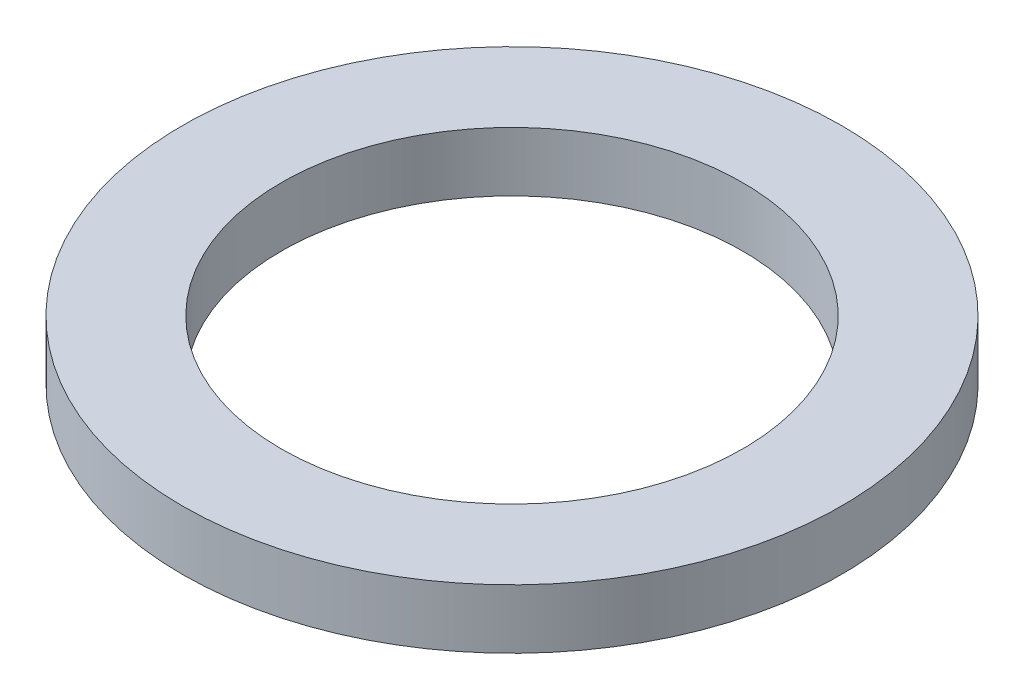
ISO-10303-21;
HEADER;
FILE_DESCRIPTION(('STEP AP214'),'2;1');
FILE_NAME('part.step','',(''),(''),'','','');
FILE_SCHEMA(('AUTOMOTIVE_DESIGN { 1 0 10303 214 1 1 1 1 }'));
ENDSEC;
DATA;
#1=APPLICATION_CONTEXT('core data for automotive mechanical design processes');
#2=APPLICATION_PROTOCOL_DEFINITION('international standard','automotive_design',2000,#1);
#3=PRODUCT_CONTEXT('',#1,'mechanical');
#4=PRODUCT('Part','Part','',(#3));
#5=PRODUCT_RELATED_PRODUCT_CATEGORY('part','',(#4));
#6=PRODUCT_DEFINITION_FORMATION('','',#4);
#7=PRODUCT_DEFINITION_CONTEXT('part definition',#1,'design');
#8=PRODUCT_DEFINITION('design','',#6,#7);
#9=PRODUCT_DEFINITION_SHAPE('','',#8);
#10=(LENGTH_UNIT() NAMED_UNIT(*) SI_UNIT(.MILLI.,.METRE.));
#11=(NAMED_UNIT(*) PLANE_ANGLE_UNIT() SI_UNIT($,.RADIAN.));
#12=(NAMED_UNIT(*) SI_UNIT($,.STERADIAN.) SOLID_ANGLE_UNIT());
#13=UNCERTAINTY_MEASURE_WITH_UNIT(LENGTH_MEASURE(1.E-05),#10,'distance_accuracy_value','');
#14=(GEOMETRIC_REPRESENTATION_CONTEXT(3) GLOBAL_UNCERTAINTY_ASSIGNED_CONTEXT((#13)) GLOBAL_UNIT_ASSIGNED_CONTEXT((#10,
#11,#12)) REPRESENTATION_CONTEXT('',''));
#15=CARTESIAN_POINT('',(0.,0.,0.));
#16=DIRECTION('',(0.,0.,1.));
#17=DIRECTION('',(1.,0.,0.));
#18=AXIS2_PLACEMENT_3D('',#15,#16,#17);
#19=CARTESIAN_POINT('',(0.,9.,0.));
#20=DIRECTION('',(0.,-1.,0.));
#21=DIRECTION('',(0.,0.,-1.));
#22=AXIS2_PLACEMENT_3D('',#19,#20,#21);
#23=CYLINDRICAL_SURFACE('',#22,50.);
#24=CARTESIAN_POINT('',(0.,9.,0.));
#25=DIRECTION('',(0.,1.,0.));
#26=DIRECTION('',(0.,0.,1.));
#27=AXIS2_PLACEMENT_3D('',#24,#25,#26);
#28=CIRCLE('',#27,50.);
#29=CARTESIAN_POINT('',(0.,9.,50.));
#30=VERTEX_POINT('',#29);
#31=EDGE_CURVE('E10',#30,#30,#28,.T.);
#32=ORIENTED_EDGE('',*,*,#31,.F.);
#33=EDGE_LOOP('',(#32));
#34=FACE_BOUND('',#33,.T.);
#35=CARTESIAN_POINT('',(0.,0.,0.));
#36=DIRECTION('',(0.,1.,0.));
#37=DIRECTION('',(0.,0.,1.));
#38=AXIS2_PLACEMENT_3D('',#35,#36,#37);
#39=CIRCLE('',#38,50.);
#40=CARTESIAN_POINT('',(0.,0.,50.));
#41=VERTEX_POINT('',#40);
#42=EDGE_CURVE('E37',#41,#41,#39,.T.);
#43=ORIENTED_EDGE('',*,*,#42,.T.);
#44=EDGE_LOOP('',(#43));
#45=FACE_BOUND('',#44,.T.);
#46=ADVANCED_FACE('F40',(#34,#45),#23,.T.);
#47=CARTESIAN_POINT('',(0.,9.,0.));
#48=DIRECTION('',(0.,1.,0.));
#49=DIRECTION('',(0.,0.,1.));
#50=AXIS2_PLACEMENT_3D('',#47,#48,#49);
#51=PLANE('',#50);
#52=CARTESIAN_POINT('',(0.,9.,0.));
#53=DIRECTION('',(0.,1.,0.));
#54=DIRECTION('',(0.,0.,1.));
#55=AXIS2_PLACEMENT_3D('',#52,#53,#54);
#56=CIRCLE('',#55,35.);
#57=CARTESIAN_POINT('',(0.,9.,35.));
#58=VERTEX_POINT('',#57);
#59=EDGE_CURVE('E50',#58,#58,#56,.T.);
#60=ORIENTED_EDGE('',*,*,#59,.F.);
#61=EDGE_LOOP('',(#60));
#62=FACE_BOUND('',#61,.T.);
#63=ORIENTED_EDGE('',*,*,#31,.T.);
#64=EDGE_LOOP('',(#63));
#65=FACE_BOUND('',#64,.T.);
#66=ADVANCED_FACE('F59',(#62,#65),#51,.T.);
#67=CARTESIAN_POINT('',(0.,0.,0.));
#68=DIRECTION('',(0.,1.,0.));
#69=DIRECTION('',(0.,0.,1.));
#70=AXIS2_PLACEMENT_3D('',#67,#68,#69);
#71=PLANE('',#70);
#72=CARTESIAN_POINT('',(0.,0.,0.));
#73=DIRECTION('',(0.,1.,0.));
#74=DIRECTION('',(0.,0.,1.));
#75=AXIS2_PLACEMENT_3D('',#72,#73,#74);
#76=CIRCLE('',#75,35.);
#77=CARTESIAN_POINT('',(0.,0.,35.));
#78=VERTEX_POINT('',#77);
#79=EDGE_CURVE('E47',#78,#78,#76,.T.);
#80=ORIENTED_EDGE('',*,*,#79,.T.);
#81=EDGE_LOOP('',(#80));
#82=FACE_BOUND('',#81,.T.);
#83=ORIENTED_EDGE('',*,*,#42,.F.);
#84=EDGE_LOOP('',(#83));
#85=FACE_BOUND('',#84,.T.);
#86=ADVANCED_FACE('F58',(#82,#85),#71,.F.);
#87=CARTESIAN_POINT('',(0.,9.,0.));
#88=DIRECTION('',(0.,-1.,0.));
#89=DIRECTION('',(0.,0.,-1.));
#90=AXIS2_PLACEMENT_3D('',#87,#88,#89);
#91=CYLINDRICAL_SURFACE('',#90,35.);
#92=ORIENTED_EDGE('',*,*,#59,.T.);
#93=EDGE_LOOP('',(#92));
#94=FACE_BOUND('',#93,.T.);
#95=ORIENTED_EDGE('',*,*,#79,.F.);
#96=EDGE_LOOP('',(#95));
#97=FACE_BOUND('',#96,.T.);
#98=ADVANCED_FACE('F54',(#94,#97),#91,.F.);
#99=CLOSED_SHELL('',(#46,#66,#86,#98));
#100=MANIFOLD_SOLID_BREP('B2',#99);
#101=ADVANCED_BREP_SHAPE_REPRESENTATION('',(#18,#100),#14);
#102=SHAPE_DEFINITION_REPRESENTATION(#9,#101);
ENDSEC;
END-ISO-10303-21;
